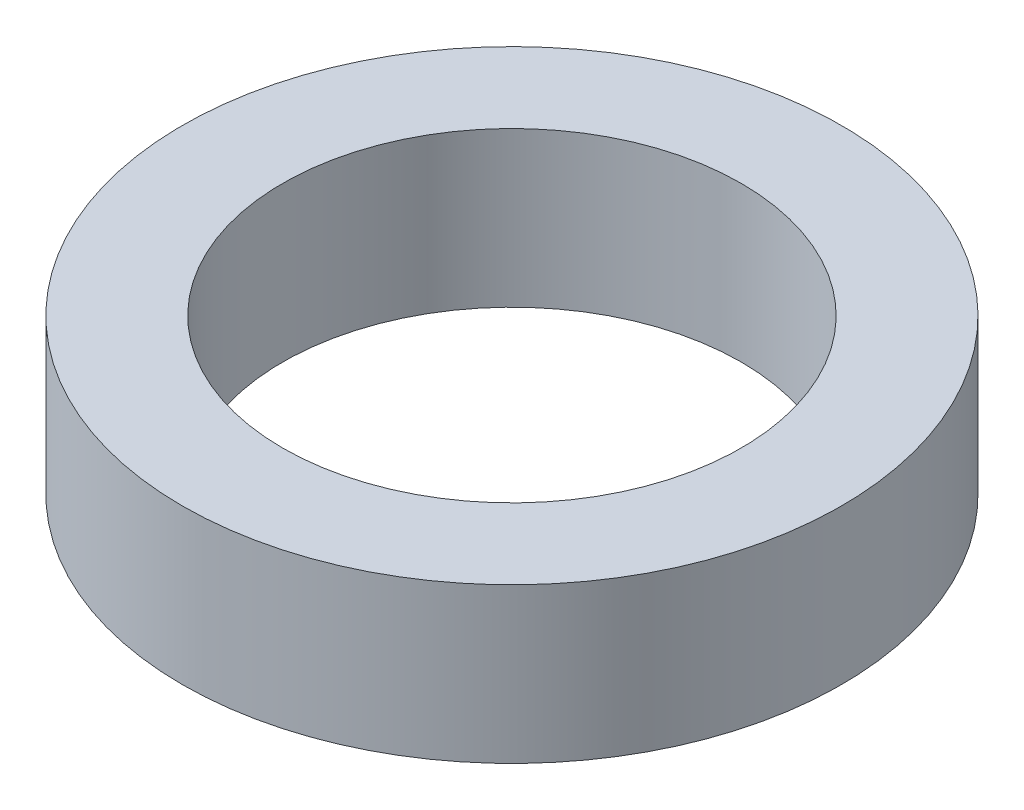
ISO-10303-21;
HEADER;
FILE_DESCRIPTION(('STEP AP214'),'2;1');
FILE_NAME('part.step','',(''),(''),'','','');
FILE_SCHEMA(('AUTOMOTIVE_DESIGN { 1 0 10303 214 1 1 1 1 }'));
ENDSEC;
DATA;
#1=APPLICATION_CONTEXT('core data for automotive mechanical design processes');
#2=APPLICATION_PROTOCOL_DEFINITION('international standard','automotive_design',2000,#1);
#3=PRODUCT_CONTEXT('',#1,'mechanical');
#4=PRODUCT('Part','Part','',(#3));
#5=PRODUCT_RELATED_PRODUCT_CATEGORY('part','',(#4));
#6=PRODUCT_DEFINITION_FORMATION('','',#4);
#7=PRODUCT_DEFINITION_CONTEXT('part definition',#1,'design');
#8=PRODUCT_DEFINITION('design','',#6,#7);
#9=PRODUCT_DEFINITION_SHAPE('','',#8);
#10=(LENGTH_UNIT() NAMED_UNIT(*) SI_UNIT(.MILLI.,.METRE.));
#11=(NAMED_UNIT(*) PLANE_ANGLE_UNIT() SI_UNIT($,.RADIAN.));
#12=(NAMED_UNIT(*) SI_UNIT($,.STERADIAN.) SOLID_ANGLE_UNIT());
#13=UNCERTAINTY_MEASURE_WITH_UNIT(LENGTH_MEASURE(1.E-05),#10,'distance_accuracy_value','');
#14=(GEOMETRIC_REPRESENTATION_CONTEXT(3) GLOBAL_UNCERTAINTY_ASSIGNED_CONTEXT((#13)) GLOBAL_UNIT_ASSIGNED_CONTEXT((#10,
#11,#12)) REPRESENTATION_CONTEXT('',''));
#15=CARTESIAN_POINT('',(0.,0.,0.));
#16=DIRECTION('',(0.,0.,1.));
#17=DIRECTION('',(1.,0.,0.));
#18=AXIS2_PLACEMENT_3D('',#15,#16,#17);
#19=CARTESIAN_POINT('',(0.,27.,0.));
#20=DIRECTION('',(0.,-1.,0.));
#21=DIRECTION('',(0.,0.,-1.));
#22=AXIS2_PLACEMENT_3D('',#19,#20,#21);
#23=CYLINDRICAL_SURFACE('',#22,57.5);
#24=CARTESIAN_POINT('',(0.,27.,0.));
#25=DIRECTION('',(0.,1.,0.));
#26=DIRECTION('',(0.,0.,1.));
#27=AXIS2_PLACEMENT_3D('',#24,#25,#26);
#28=CIRCLE('',#27,57.5);
#29=CARTESIAN_POINT('',(0.,27.,57.5));
#30=VERTEX_POINT('',#29);
#31=EDGE_CURVE('E10',#30,#30,#28,.T.);
#32=ORIENTED_EDGE('',*,*,#31,.F.);
#33=EDGE_LOOP('',(#32));
#34=FACE_BOUND('',#33,.T.);
#35=CARTESIAN_POINT('',(0.,0.,0.));
#36=DIRECTION('',(0.,1.,0.));
#37=DIRECTION('',(0.,0.,1.));
#38=AXIS2_PLACEMENT_3D('',#35,#36,#37);
#39=CIRCLE('',#38,57.5);
#40=CARTESIAN_POINT('',(0.,0.,57.5));
#41=VERTEX_POINT('',#40);
#42=EDGE_CURVE('E37',#41,#41,#39,.T.);
#43=ORIENTED_EDGE('',*,*,#42,.T.);
#44=EDGE_LOOP('',(#43));
#45=FACE_BOUND('',#44,.T.);
#46=ADVANCED_FACE('F40',(#34,#45),#23,.T.);
#47=CARTESIAN_POINT('',(0.,27.,0.));
#48=DIRECTION('',(0.,1.,0.));
#49=DIRECTION('',(0.,0.,1.));
#50=AXIS2_PLACEMENT_3D('',#47,#48,#49);
#51=PLANE('',#50);
#52=CARTESIAN_POINT('',(0.,27.,0.));
#53=DIRECTION('',(0.,1.,0.));
#54=DIRECTION('',(0.,0.,1.));
#55=AXIS2_PLACEMENT_3D('',#52,#53,#54);
#56=CIRCLE('',#55,40.);
#57=CARTESIAN_POINT('',(0.,27.,40.));
#58=VERTEX_POINT('',#57);
#59=EDGE_CURVE('E50',#58,#58,#56,.T.);
#60=ORIENTED_EDGE('',*,*,#59,.F.);
#61=EDGE_LOOP('',(#60));
#62=FACE_BOUND('',#61,.T.);
#63=ORIENTED_EDGE('',*,*,#31,.T.);
#64=EDGE_LOOP('',(#63));
#65=FACE_BOUND('',#64,.T.);
#66=ADVANCED_FACE('F59',(#62,#65),#51,.T.);
#67=CARTESIAN_POINT('',(0.,0.,0.));
#68=DIRECTION('',(0.,1.,0.));
#69=DIRECTION('',(0.,0.,1.));
#70=AXIS2_PLACEMENT_3D('',#67,#68,#69);
#71=PLANE('',#70);
#72=CARTESIAN_POINT('',(0.,0.,0.));
#73=DIRECTION('',(0.,1.,0.));
#74=DIRECTION('',(0.,0.,1.));
#75=AXIS2_PLACEMENT_3D('',#72,#73,#74);
#76=CIRCLE('',#75,40.);
#77=CARTESIAN_POINT('',(0.,0.,40.));
#78=VERTEX_POINT('',#77);
#79=EDGE_CURVE('E47',#78,#78,#76,.T.);
#80=ORIENTED_EDGE('',*,*,#79,.T.);
#81=EDGE_LOOP('',(#80));
#82=FACE_BOUND('',#81,.T.);
#83=ORIENTED_EDGE('',*,*,#42,.F.);
#84=EDGE_LOOP('',(#83));
#85=FACE_BOUND('',#84,.T.);
#86=ADVANCED_FACE('F58',(#82,#85),#71,.F.);
#87=CARTESIAN_POINT('',(0.,27.,0.));
#88=DIRECTION('',(0.,-1.,0.));
#89=DIRECTION('',(0.,0.,-1.));
#90=AXIS2_PLACEMENT_3D('',#87,#88,#89);
#91=CYLINDRICAL_SURFACE('',#90,40.);
#92=ORIENTED_EDGE('',*,*,#59,.T.);
#93=EDGE_LOOP('',(#92));
#94=FACE_BOUND('',#93,.T.);
#95=ORIENTED_EDGE('',*,*,#79,.F.);
#96=EDGE_LOOP('',(#95));
#97=FACE_BOUND('',#96,.T.);
#98=ADVANCED_FACE('F54',(#94,#97),#91,.F.);
#99=CLOSED_SHELL('',(#46,#66,#86,#98));
#100=MANIFOLD_SOLID_BREP('B2',#99);
#101=ADVANCED_BREP_SHAPE_REPRESENTATION('',(#18,#100),#14);
#102=SHAPE_DEFINITION_REPRESENTATION(#9,#101);
ENDSEC;
END-ISO-10303-21;
